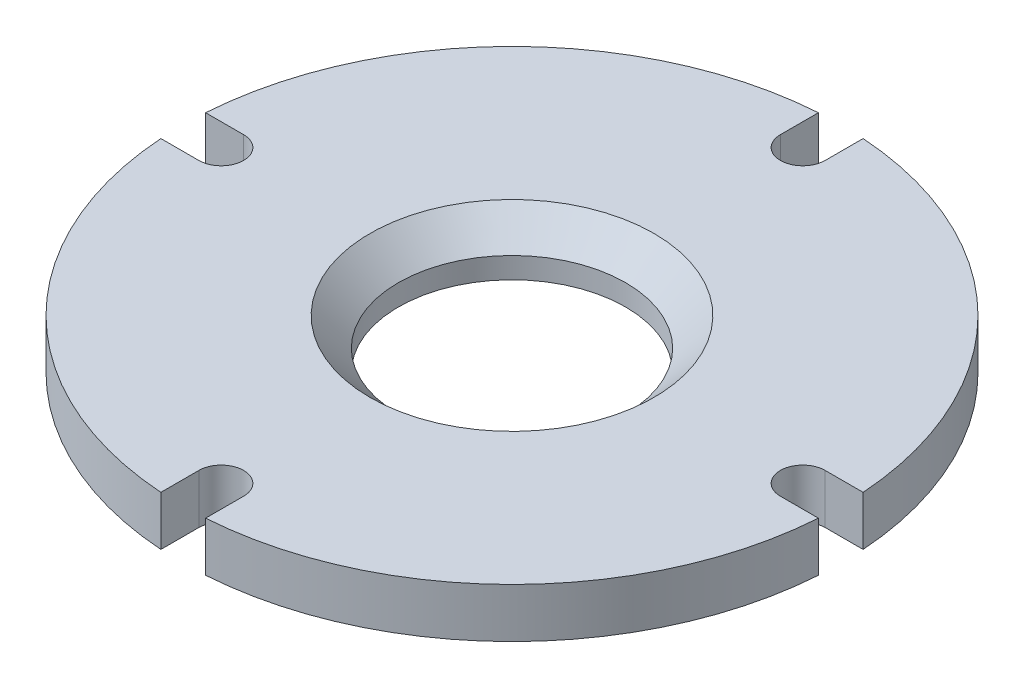
ISO-10303-21;
HEADER;
FILE_DESCRIPTION(('STEP AP214'),'2;1');
FILE_NAME('part.step','',(''),(''),'','','');
FILE_SCHEMA(('AUTOMOTIVE_DESIGN { 1 0 10303 214 1 1 1 1 }'));
ENDSEC;
DATA;
#1=APPLICATION_CONTEXT('core data for automotive mechanical design processes');
#2=APPLICATION_PROTOCOL_DEFINITION('international standard','automotive_design',2000,#1);
#3=PRODUCT_CONTEXT('',#1,'mechanical');
#4=PRODUCT('Part','Part','',(#3));
#5=PRODUCT_RELATED_PRODUCT_CATEGORY('part','',(#4));
#6=PRODUCT_DEFINITION_FORMATION('','',#4);
#7=PRODUCT_DEFINITION_CONTEXT('part definition',#1,'design');
#8=PRODUCT_DEFINITION('design','',#6,#7);
#9=PRODUCT_DEFINITION_SHAPE('','',#8);
#10=(LENGTH_UNIT() NAMED_UNIT(*) SI_UNIT(.MILLI.,.METRE.));
#11=(NAMED_UNIT(*) PLANE_ANGLE_UNIT() SI_UNIT($,.RADIAN.));
#12=(NAMED_UNIT(*) SI_UNIT($,.STERADIAN.) SOLID_ANGLE_UNIT());
#13=UNCERTAINTY_MEASURE_WITH_UNIT(LENGTH_MEASURE(1.E-05),#10,'distance_accuracy_value','');
#14=(GEOMETRIC_REPRESENTATION_CONTEXT(3) GLOBAL_UNCERTAINTY_ASSIGNED_CONTEXT((#13)) GLOBAL_UNIT_ASSIGNED_CONTEXT((#10,
#11,#12)) REPRESENTATION_CONTEXT('',''));
#15=CARTESIAN_POINT('',(0.,0.,0.));
#16=DIRECTION('',(0.,0.,1.));
#17=DIRECTION('',(1.,0.,0.));
#18=AXIS2_PLACEMENT_3D('',#15,#16,#17);
#19=CARTESIAN_POINT('',(0.,-5.53079166666667,0.));
#20=DIRECTION('',(0.,-1.,0.));
#21=DIRECTION('',(0.,0.,-1.));
#22=AXIS2_PLACEMENT_3D('',#19,#20,#21);
#23=PLANE('',#22);
#24=CARTESIAN_POINT('',(0.,-5.53079166666667,0.));
#25=DIRECTION('',(0.,-1.,0.));
#26=DIRECTION('',(0.,0.,-1.));
#27=AXIS2_PLACEMENT_3D('',#24,#25,#26);
#28=CIRCLE('',#27,12.7);
#29=CARTESIAN_POINT('',(0.,-5.53079166666667,-12.7));
#30=VERTEX_POINT('',#29);
#31=EDGE_CURVE('E332',#30,#30,#28,.T.);
#32=ORIENTED_EDGE('',*,*,#31,.F.);
#33=EDGE_LOOP('',(#32));
#34=FACE_BOUND('',#33,.T.);
#35=CARTESIAN_POINT('',(0.,-5.53079166666667,0.));
#36=DIRECTION('',(0.,-1.,0.));
#37=DIRECTION('',(0.,0.,-1.));
#38=AXIS2_PLACEMENT_3D('',#35,#36,#37);
#39=CIRCLE('',#38,13.97);
#40=CARTESIAN_POINT('',(0.,-5.53079166666667,-13.97));
#41=VERTEX_POINT('',#40);
#42=EDGE_CURVE('E767',#41,#41,#39,.T.);
#43=ORIENTED_EDGE('',*,*,#42,.T.);
#44=EDGE_LOOP('',(#43));
#45=FACE_BOUND('',#44,.T.);
#46=ADVANCED_FACE('F41',(#34,#45),#23,.T.);
#47=CARTESIAN_POINT('',(0.,-5.52979166666667,0.));
#48=DIRECTION('',(0.,1.,0.));
#49=DIRECTION('',(0.,0.,1.));
#50=AXIS2_PLACEMENT_3D('',#47,#48,#49);
#51=CYLINDRICAL_SURFACE('',#50,36.83);
#52=DIRECTION('',(0.,1.,0.));
#53=VECTOR('',#52,1.);
#54=CARTESIAN_POINT('',(36.7450527282245,-5.52979166666667,2.49999999999987));
#55=LINE('',#54,#53);
#56=CARTESIAN_POINT('',(36.7450527282245,0.,2.49999999999987));
#57=VERTEX_POINT('',#56);
#58=CARTESIAN_POINT('',(36.7450527282245,-5.52979166666667,2.49999999999987));
#59=VERTEX_POINT('',#58);
#60=EDGE_CURVE('E273',#57,#59,#55,.F.);
#61=ORIENTED_EDGE('',*,*,#60,.F.);
#62=CARTESIAN_POINT('',(0.,0.,0.));
#63=DIRECTION('',(0.,1.,0.));
#64=DIRECTION('',(0.,0.,1.));
#65=AXIS2_PLACEMENT_3D('',#62,#63,#64);
#66=CIRCLE('',#65,36.83);
#67=CARTESIAN_POINT('',(2.5,0.,36.7450527282245));
#68=VERTEX_POINT('',#67);
#69=EDGE_CURVE('E355',#68,#57,#66,.T.);
#70=ORIENTED_EDGE('',*,*,#69,.F.);
#71=DIRECTION('',(0.,1.,0.));
#72=VECTOR('',#71,1.);
#73=CARTESIAN_POINT('',(2.5,-5.52979166666667,36.7450527282245));
#74=LINE('',#73,#72);
#75=CARTESIAN_POINT('',(2.5,-5.52979166666667,36.7450527282245));
#76=VERTEX_POINT('',#75);
#77=EDGE_CURVE('E299',#76,#68,#74,.T.);
#78=ORIENTED_EDGE('',*,*,#77,.F.);
#79=CARTESIAN_POINT('',(0.,-5.52979166666667,0.));
#80=DIRECTION('',(0.,1.,0.));
#81=DIRECTION('',(0.,0.,1.));
#82=AXIS2_PLACEMENT_3D('',#79,#80,#81);
#83=CIRCLE('',#82,36.83);
#84=EDGE_CURVE('E354',#76,#59,#83,.T.);
#85=ORIENTED_EDGE('',*,*,#84,.T.);
#86=EDGE_LOOP('',(#61,#70,#78,#85));
#87=FACE_BOUND('',#86,.T.);
#88=ADVANCED_FACE('F393',(#87),#51,.T.);
#89=DIRECTION('',(0.,1.,0.));
#90=VECTOR('',#89,1.);
#91=CARTESIAN_POINT('',(36.7450527282245,-5.52979166666667,-2.50000000000013));
#92=LINE('',#91,#90);
#93=CARTESIAN_POINT('',(36.7450527282245,-5.52979166666667,-2.50000000000013));
#94=VERTEX_POINT('',#93);
#95=CARTESIAN_POINT('',(36.7450527282245,0.,-2.50000000000013));
#96=VERTEX_POINT('',#95);
#97=EDGE_CURVE('E187',#94,#96,#92,.T.);
#98=ORIENTED_EDGE('',*,*,#97,.F.);
#99=CARTESIAN_POINT('',(2.5,-5.52979166666667,-36.7450527282245));
#100=VERTEX_POINT('',#99);
#101=EDGE_CURVE('E363',#94,#100,#83,.T.);
#102=ORIENTED_EDGE('',*,*,#101,.T.);
#103=DIRECTION('',(0.,1.,0.));
#104=VECTOR('',#103,1.);
#105=CARTESIAN_POINT('',(2.5,-5.52979166666667,-36.7450527282245));
#106=LINE('',#105,#104);
#107=CARTESIAN_POINT('',(2.5,0.,-36.7450527282245));
#108=VERTEX_POINT('',#107);
#109=EDGE_CURVE('E268',#108,#100,#106,.F.);
#110=ORIENTED_EDGE('',*,*,#109,.F.);
#111=EDGE_CURVE('E359',#96,#108,#66,.T.);
#112=ORIENTED_EDGE('',*,*,#111,.F.);
#113=EDGE_LOOP('',(#98,#102,#110,#112));
#114=FACE_BOUND('',#113,.T.);
#115=ADVANCED_FACE('F400',(#114),#51,.T.);
#116=DIRECTION('',(0.,1.,0.));
#117=VECTOR('',#116,1.);
#118=CARTESIAN_POINT('',(-2.5,-5.52979166666667,-36.7450527282245));
#119=LINE('',#118,#117);
#120=CARTESIAN_POINT('',(-2.5,-5.52979166666667,-36.7450527282245));
#121=VERTEX_POINT('',#120);
#122=CARTESIAN_POINT('',(-2.5,0.,-36.7450527282245));
#123=VERTEX_POINT('',#122);
#124=EDGE_CURVE('E65',#121,#123,#119,.T.);
#125=ORIENTED_EDGE('',*,*,#124,.F.);
#126=CARTESIAN_POINT('',(-36.7450527282245,-5.52979166666667,-2.49999999999962));
#127=VERTEX_POINT('',#126);
#128=EDGE_CURVE('E467',#121,#127,#83,.T.);
#129=ORIENTED_EDGE('',*,*,#128,.T.);
#130=DIRECTION('',(0.,1.,0.));
#131=VECTOR('',#130,1.);
#132=CARTESIAN_POINT('',(-36.7450527282245,-5.52979166666667,-2.49999999999961));
#133=LINE('',#132,#131);
#134=CARTESIAN_POINT('',(-36.7450527282245,0.,-2.49999999999962));
#135=VERTEX_POINT('',#134);
#136=EDGE_CURVE('E263',#135,#127,#133,.F.);
#137=ORIENTED_EDGE('',*,*,#136,.F.);
#138=EDGE_CURVE('E488',#123,#135,#66,.T.);
#139=ORIENTED_EDGE('',*,*,#138,.F.);
#140=EDGE_LOOP('',(#125,#129,#137,#139));
#141=FACE_BOUND('',#140,.T.);
#142=ADVANCED_FACE('F442',(#141),#51,.T.);
#143=DIRECTION('',(0.,1.,0.));
#144=VECTOR('',#143,1.);
#145=CARTESIAN_POINT('',(-36.7450527282245,-5.52979166666667,2.50000000000038));
#146=LINE('',#145,#144);
#147=CARTESIAN_POINT('',(-36.7450527282245,-5.52979166666667,2.50000000000038));
#148=VERTEX_POINT('',#147);
#149=CARTESIAN_POINT('',(-36.7450527282245,0.,2.50000000000038));
#150=VERTEX_POINT('',#149);
#151=EDGE_CURVE('E57',#148,#150,#146,.T.);
#152=ORIENTED_EDGE('',*,*,#151,.F.);
#153=CARTESIAN_POINT('',(-2.5,-5.52979166666667,36.7450527282245));
#154=VERTEX_POINT('',#153);
#155=EDGE_CURVE('E358',#148,#154,#83,.T.);
#156=ORIENTED_EDGE('',*,*,#155,.T.);
#157=DIRECTION('',(0.,1.,0.));
#158=VECTOR('',#157,1.);
#159=CARTESIAN_POINT('',(-2.5,-5.52979166666667,36.7450527282245));
#160=LINE('',#159,#158);
#161=CARTESIAN_POINT('',(-2.5,0.,36.7450527282245));
#162=VERTEX_POINT('',#161);
#163=EDGE_CURVE('E304',#162,#154,#160,.F.);
#164=ORIENTED_EDGE('',*,*,#163,.F.);
#165=EDGE_CURVE('E348',#150,#162,#66,.T.);
#166=ORIENTED_EDGE('',*,*,#165,.F.);
#167=EDGE_LOOP('',(#152,#156,#164,#166));
#168=FACE_BOUND('',#167,.T.);
#169=ADVANCED_FACE('F402',(#168),#51,.T.);
#170=CARTESIAN_POINT('',(36.83,-5.52979166666667,0.));
#171=DIRECTION('',(0.,-1.,0.));
#172=DIRECTION('',(0.,0.,-1.));
#173=AXIS2_PLACEMENT_3D('',#170,#171,#172);
#174=PLANE('',#173);
#175=DIRECTION('',(-1.,0.,0.));
#176=VECTOR('',#175,1.);
#177=CARTESIAN_POINT('',(32.5,-5.52979166666667,2.49999999999989));
#178=LINE('',#177,#176);
#179=CARTESIAN_POINT('',(32.5,-5.52979166666667,2.49999999999989));
#180=VERTEX_POINT('',#179);
#181=EDGE_CURVE('E197',#59,#180,#178,.T.);
#182=ORIENTED_EDGE('',*,*,#181,.F.);
#183=ORIENTED_EDGE('',*,*,#84,.F.);
#184=DIRECTION('',(0.,0.,1.));
#185=VECTOR('',#184,1.);
#186=CARTESIAN_POINT('',(2.5,-5.52979166666667,32.5));
#187=LINE('',#186,#185);
#188=CARTESIAN_POINT('',(2.5,-5.52979166666667,32.5));
#189=VERTEX_POINT('',#188);
#190=EDGE_CURVE('E290',#189,#76,#187,.T.);
#191=ORIENTED_EDGE('',*,*,#190,.F.);
#192=CARTESIAN_POINT('',(0.,-5.52979166666667,32.5));
#193=DIRECTION('',(0.,-1.,0.));
#194=DIRECTION('',(0.,0.,-1.));
#195=AXIS2_PLACEMENT_3D('',#192,#193,#194);
#196=CIRCLE('',#195,2.5);
#197=CARTESIAN_POINT('',(-2.5,-5.52979166666667,32.5));
#198=VERTEX_POINT('',#197);
#199=EDGE_CURVE('E276',#198,#189,#196,.T.);
#200=ORIENTED_EDGE('',*,*,#199,.F.);
#201=DIRECTION('',(0.,0.,-1.));
#202=VECTOR('',#201,1.);
#203=CARTESIAN_POINT('',(-2.5,-5.52979166666667,32.5));
#204=LINE('',#203,#202);
#205=EDGE_CURVE('E282',#154,#198,#204,.T.);
#206=ORIENTED_EDGE('',*,*,#205,.F.);
#207=ORIENTED_EDGE('',*,*,#155,.F.);
#208=DIRECTION('',(-1.,0.,0.));
#209=VECTOR('',#208,1.);
#210=CARTESIAN_POINT('',(-32.5,-5.52979166666667,2.50000000000034));
#211=LINE('',#210,#209);
#212=CARTESIAN_POINT('',(-32.5,-5.52979166666667,2.50000000000034));
#213=VERTEX_POINT('',#212);
#214=EDGE_CURVE('E250',#213,#148,#211,.T.);
#215=ORIENTED_EDGE('',*,*,#214,.F.);
#216=CARTESIAN_POINT('',(-32.5,-5.52979166666667,3.40393242855307E-13));
#217=DIRECTION('',(0.,-1.,0.));
#218=DIRECTION('',(1.,0.,0.));
#219=AXIS2_PLACEMENT_3D('',#216,#217,#218);
#220=CIRCLE('',#219,2.5);
#221=CARTESIAN_POINT('',(-32.5,-5.52979166666667,-2.49999999999966));
#222=VERTEX_POINT('',#221);
#223=EDGE_CURVE('E246',#222,#213,#220,.T.);
#224=ORIENTED_EDGE('',*,*,#223,.F.);
#225=DIRECTION('',(1.,0.,0.));
#226=VECTOR('',#225,1.);
#227=CARTESIAN_POINT('',(-32.5,-5.52979166666667,-2.49999999999966));
#228=LINE('',#227,#226);
#229=EDGE_CURVE('E242',#127,#222,#228,.T.);
#230=ORIENTED_EDGE('',*,*,#229,.F.);
#231=ORIENTED_EDGE('',*,*,#128,.F.);
#232=DIRECTION('',(0.,0.,-1.));
#233=VECTOR('',#232,1.);
#234=CARTESIAN_POINT('',(-2.5,-5.52979166666667,-32.5));
#235=LINE('',#234,#233);
#236=CARTESIAN_POINT('',(-2.5,-5.52979166666667,-32.5));
#237=VERTEX_POINT('',#236);
#238=EDGE_CURVE('E226',#237,#121,#235,.T.);
#239=ORIENTED_EDGE('',*,*,#238,.F.);
#240=CARTESIAN_POINT('',(0.,-5.52979166666667,-32.5));
#241=DIRECTION('',(0.,-1.,0.));
#242=DIRECTION('',(0.,0.,1.));
#243=AXIS2_PLACEMENT_3D('',#240,#241,#242);
#244=CIRCLE('',#243,2.5);
#245=CARTESIAN_POINT('',(2.5,-5.52979166666667,-32.5));
#246=VERTEX_POINT('',#245);
#247=EDGE_CURVE('E222',#246,#237,#244,.T.);
#248=ORIENTED_EDGE('',*,*,#247,.F.);
#249=DIRECTION('',(0.,0.,1.));
#250=VECTOR('',#249,1.);
#251=CARTESIAN_POINT('',(2.5,-5.52979166666667,-32.5));
#252=LINE('',#251,#250);
#253=EDGE_CURVE('E218',#100,#246,#252,.T.);
#254=ORIENTED_EDGE('',*,*,#253,.F.);
#255=ORIENTED_EDGE('',*,*,#101,.F.);
#256=DIRECTION('',(1.,0.,0.));
#257=VECTOR('',#256,1.);
#258=CARTESIAN_POINT('',(32.5,-5.52979166666667,-2.50000000000011));
#259=LINE('',#258,#257);
#260=CARTESIAN_POINT('',(32.5,-5.52979166666667,-2.50000000000011));
#261=VERTEX_POINT('',#260);
#262=EDGE_CURVE('E200',#261,#94,#259,.T.);
#263=ORIENTED_EDGE('',*,*,#262,.F.);
#264=CARTESIAN_POINT('',(32.5,-5.52979166666667,-1.13446955830504E-13));
#265=DIRECTION('',(0.,-1.,0.));
#266=DIRECTION('',(-1.,0.,0.));
#267=AXIS2_PLACEMENT_3D('',#264,#265,#266);
#268=CIRCLE('',#267,2.5);
#269=EDGE_CURVE('E177',#180,#261,#268,.T.);
#270=ORIENTED_EDGE('',*,*,#269,.F.);
#271=EDGE_LOOP('',(#182,#183,#191,#200,#206,#207,#215,#224,#230,#231,#239,#248,#254,#255,#263,#270));
#272=FACE_BOUND('',#271,.T.);
#273=CARTESIAN_POINT('',(0.,-5.52979166666667,0.));
#274=DIRECTION('',(0.,-1.,0.));
#275=DIRECTION('',(0.,0.,-1.));
#276=AXIS2_PLACEMENT_3D('',#273,#274,#275);
#277=CIRCLE('',#276,27.5);
#278=CARTESIAN_POINT('',(0.,-5.52979166666667,-27.5));
#279=VERTEX_POINT('',#278);
#280=EDGE_CURVE('E349',#279,#279,#277,.T.);
#281=ORIENTED_EDGE('',*,*,#280,.F.);
#282=EDGE_LOOP('',(#281));
#283=FACE_BOUND('',#282,.T.);
#284=ADVANCED_FACE('F433',(#272,#283),#174,.T.);
#285=CARTESIAN_POINT('',(0.,0.,0.));
#286=DIRECTION('',(0.,1.,0.));
#287=DIRECTION('',(0.,0.,1.));
#288=AXIS2_PLACEMENT_3D('',#285,#286,#287);
#289=PLANE('',#288);
#290=CARTESIAN_POINT('',(0.,0.,0.));
#291=DIRECTION('',(0.,1.,0.));
#292=DIRECTION('',(0.,0.,1.));
#293=AXIS2_PLACEMENT_3D('',#290,#291,#292);
#294=CIRCLE('',#293,15.875);
#295=CARTESIAN_POINT('',(0.,0.,15.875));
#296=VERTEX_POINT('',#295);
#297=EDGE_CURVE('E50',#296,#296,#294,.F.);
#298=ORIENTED_EDGE('',*,*,#297,.T.);
#299=EDGE_LOOP('',(#298));
#300=FACE_BOUND('',#299,.T.);
#301=DIRECTION('',(1.,0.,0.));
#302=VECTOR('',#301,1.);
#303=CARTESIAN_POINT('',(0.,0.,2.5));
#304=LINE('',#303,#302);
#305=CARTESIAN_POINT('',(32.5,0.,2.49999999999989));
#306=VERTEX_POINT('',#305);
#307=EDGE_CURVE('E195',#306,#57,#304,.T.);
#308=ORIENTED_EDGE('',*,*,#307,.F.);
#309=CARTESIAN_POINT('',(32.5,0.,-1.13446955830504E-13));
#310=DIRECTION('',(0.,-1.,0.));
#311=DIRECTION('',(-1.,0.,0.));
#312=AXIS2_PLACEMENT_3D('',#309,#310,#311);
#313=CIRCLE('',#312,2.5);
#314=CARTESIAN_POINT('',(32.5,0.,-2.50000000000011));
#315=VERTEX_POINT('',#314);
#316=EDGE_CURVE('E174',#306,#315,#313,.T.);
#317=ORIENTED_EDGE('',*,*,#316,.T.);
#318=DIRECTION('',(1.,0.,0.));
#319=VECTOR('',#318,1.);
#320=CARTESIAN_POINT('',(32.5,0.,-2.50000000000011));
#321=LINE('',#320,#319);
#322=EDGE_CURVE('E182',#315,#96,#321,.T.);
#323=ORIENTED_EDGE('',*,*,#322,.T.);
#324=ORIENTED_EDGE('',*,*,#111,.T.);
#325=DIRECTION('',(0.,0.,-1.));
#326=VECTOR('',#325,1.);
#327=CARTESIAN_POINT('',(2.5,0.,0.));
#328=LINE('',#327,#326);
#329=CARTESIAN_POINT('',(2.5,0.,-32.5));
#330=VERTEX_POINT('',#329);
#331=EDGE_CURVE('E370',#330,#108,#328,.T.);
#332=ORIENTED_EDGE('',*,*,#331,.F.);
#333=CARTESIAN_POINT('',(0.,0.,-32.5));
#334=DIRECTION('',(0.,-1.,0.));
#335=DIRECTION('',(0.,0.,1.));
#336=AXIS2_PLACEMENT_3D('',#333,#334,#335);
#337=CIRCLE('',#336,2.5);
#338=CARTESIAN_POINT('',(-2.5,0.,-32.5));
#339=VERTEX_POINT('',#338);
#340=EDGE_CURVE('E213',#330,#339,#337,.T.);
#341=ORIENTED_EDGE('',*,*,#340,.T.);
#342=DIRECTION('',(0.,0.,-1.));
#343=VECTOR('',#342,1.);
#344=CARTESIAN_POINT('',(-2.5,0.,-32.5));
#345=LINE('',#344,#343);
#346=EDGE_CURVE('E217',#339,#123,#345,.T.);
#347=ORIENTED_EDGE('',*,*,#346,.T.);
#348=ORIENTED_EDGE('',*,*,#138,.T.);
#349=DIRECTION('',(-1.,0.,0.));
#350=VECTOR('',#349,1.);
#351=CARTESIAN_POINT('',(0.,0.,-2.5));
#352=LINE('',#351,#350);
#353=CARTESIAN_POINT('',(-32.5,0.,-2.49999999999966));
#354=VERTEX_POINT('',#353);
#355=EDGE_CURVE('E367',#354,#135,#352,.T.);
#356=ORIENTED_EDGE('',*,*,#355,.F.);
#357=CARTESIAN_POINT('',(-32.5,0.,3.40393242855307E-13));
#358=DIRECTION('',(0.,-1.,0.));
#359=DIRECTION('',(1.,0.,0.));
#360=AXIS2_PLACEMENT_3D('',#357,#358,#359);
#361=CIRCLE('',#360,2.5);
#362=CARTESIAN_POINT('',(-32.5,0.,2.50000000000034));
#363=VERTEX_POINT('',#362);
#364=EDGE_CURVE('E237',#354,#363,#361,.T.);
#365=ORIENTED_EDGE('',*,*,#364,.T.);
#366=DIRECTION('',(-1.,0.,0.));
#367=VECTOR('',#366,1.);
#368=CARTESIAN_POINT('',(-32.5,0.,2.50000000000034));
#369=LINE('',#368,#367);
#370=EDGE_CURVE('E241',#363,#150,#369,.T.);
#371=ORIENTED_EDGE('',*,*,#370,.T.);
#372=ORIENTED_EDGE('',*,*,#165,.T.);
#373=DIRECTION('',(0.,0.,1.));
#374=VECTOR('',#373,1.);
#375=CARTESIAN_POINT('',(-2.5,0.,0.));
#376=LINE('',#375,#374);
#377=CARTESIAN_POINT('',(-2.5,0.,32.5));
#378=VERTEX_POINT('',#377);
#379=EDGE_CURVE('E353',#378,#162,#376,.T.);
#380=ORIENTED_EDGE('',*,*,#379,.F.);
#381=CARTESIAN_POINT('',(0.,0.,32.5));
#382=DIRECTION('',(0.,-1.,0.));
#383=DIRECTION('',(0.,0.,-1.));
#384=AXIS2_PLACEMENT_3D('',#381,#382,#383);
#385=CIRCLE('',#384,2.5);
#386=CARTESIAN_POINT('',(2.5,0.,32.5));
#387=VERTEX_POINT('',#386);
#388=EDGE_CURVE('E277',#378,#387,#385,.T.);
#389=ORIENTED_EDGE('',*,*,#388,.T.);
#390=DIRECTION('',(0.,0.,1.));
#391=VECTOR('',#390,1.);
#392=CARTESIAN_POINT('',(2.5,0.,32.5));
#393=LINE('',#392,#391);
#394=EDGE_CURVE('E281',#387,#68,#393,.T.);
#395=ORIENTED_EDGE('',*,*,#394,.T.);
#396=ORIENTED_EDGE('',*,*,#69,.T.);
#397=EDGE_LOOP('',(#308,#317,#323,#324,#332,#341,#347,#348,#356,#365,#371,#372,#380,#389,#395,#396));
#398=FACE_BOUND('',#397,.T.);
#399=ADVANCED_FACE('F193',(#300,#398),#289,.T.);
#400=CARTESIAN_POINT('',(0.,-5.53079166666667,0.));
#401=DIRECTION('',(0.,1.,0.));
#402=DIRECTION('',(0.,0.,1.));
#403=AXIS2_PLACEMENT_3D('',#400,#401,#402);
#404=CYLINDRICAL_SURFACE('',#403,27.5);
#405=CARTESIAN_POINT('',(0.,-5.53079166666667,0.));
#406=DIRECTION('',(0.,-1.,0.));
#407=DIRECTION('',(0.,0.,-1.));
#408=AXIS2_PLACEMENT_3D('',#405,#406,#407);
#409=CIRCLE('',#408,27.5);
#410=CARTESIAN_POINT('',(0.,-5.53079166666667,-27.5));
#411=VERTEX_POINT('',#410);
#412=EDGE_CURVE('E344',#411,#411,#409,.T.);
#413=ORIENTED_EDGE('',*,*,#412,.F.);
#414=EDGE_LOOP('',(#413));
#415=FACE_BOUND('',#414,.T.);
#416=ORIENTED_EDGE('',*,*,#280,.T.);
#417=EDGE_LOOP('',(#416));
#418=FACE_BOUND('',#417,.T.);
#419=ADVANCED_FACE('F409',(#415,#418),#404,.T.);
#420=CARTESIAN_POINT('',(0.,-5.53079166666667,0.));
#421=DIRECTION('',(0.,-1.,0.));
#422=DIRECTION('',(0.,0.,-1.));
#423=AXIS2_PLACEMENT_3D('',#420,#421,#422);
#424=CIRCLE('',#423,16.2052);
#425=CARTESIAN_POINT('',(0.,-5.53079166666667,-16.2052));
#426=VERTEX_POINT('',#425);
#427=EDGE_CURVE('E203',#426,#426,#424,.T.);
#428=ORIENTED_EDGE('',*,*,#427,.F.);
#429=EDGE_LOOP('',(#428));
#430=FACE_BOUND('',#429,.T.);
#431=CARTESIAN_POINT('',(-14.6017550315024,-5.53079166666667,-14.601755031502));
#432=DIRECTION('',(0.,-1.,0.));
#433=DIRECTION('',(0.,0.,-1.));
#434=AXIS2_PLACEMENT_3D('',#431,#432,#433);
#435=CIRCLE('',#434,1.13029999999999);
#436=CARTESIAN_POINT('',(-14.6017550315024,-5.53079166666667,-15.732055031502));
#437=VERTEX_POINT('',#436);
#438=EDGE_CURVE('E308',#437,#437,#435,.T.);
#439=ORIENTED_EDGE('',*,*,#438,.F.);
#440=EDGE_LOOP('',(#439));
#441=FACE_BOUND('',#440,.T.);
#442=CARTESIAN_POINT('',(14.6017550315022,-5.53079166666667,-14.6017550315022));
#443=DIRECTION('',(0.,-1.,0.));
#444=DIRECTION('',(0.,0.,-1.));
#445=AXIS2_PLACEMENT_3D('',#442,#443,#444);
#446=CIRCLE('',#445,1.13029999999999);
#447=CARTESIAN_POINT('',(14.6017550315022,-5.53079166666667,-15.7320550315022));
#448=VERTEX_POINT('',#447);
#449=EDGE_CURVE('E316',#448,#448,#446,.T.);
#450=ORIENTED_EDGE('',*,*,#449,.F.);
#451=EDGE_LOOP('',(#450));
#452=FACE_BOUND('',#451,.T.);
#453=CARTESIAN_POINT('',(14.6017550315023,-5.53079166666667,14.6017550315021));
#454=DIRECTION('',(0.,-1.,0.));
#455=DIRECTION('',(0.,0.,-1.));
#456=AXIS2_PLACEMENT_3D('',#453,#454,#455);
#457=CIRCLE('',#456,1.13029999999999);
#458=CARTESIAN_POINT('',(14.6017550315023,-5.53079166666667,13.4714550315021));
#459=VERTEX_POINT('',#458);
#460=EDGE_CURVE('E324',#459,#459,#457,.T.);
#461=ORIENTED_EDGE('',*,*,#460,.F.);
#462=EDGE_LOOP('',(#461));
#463=FACE_BOUND('',#462,.T.);
#464=CARTESIAN_POINT('',(-14.6017550315022,-5.53079166666667,14.6017550315022));
#465=DIRECTION('',(0.,-1.,0.));
#466=DIRECTION('',(0.,0.,-1.));
#467=AXIS2_PLACEMENT_3D('',#464,#465,#466);
#468=CIRCLE('',#467,1.13029999999999);
#469=CARTESIAN_POINT('',(-14.6017550315022,-5.53079166666667,13.4714550315022));
#470=VERTEX_POINT('',#469);
#471=EDGE_CURVE('E336',#470,#470,#468,.T.);
#472=ORIENTED_EDGE('',*,*,#471,.F.);
#473=EDGE_LOOP('',(#472));
#474=FACE_BOUND('',#473,.T.);
#475=ORIENTED_EDGE('',*,*,#412,.T.);
#476=EDGE_LOOP('',(#475));
#477=FACE_BOUND('',#476,.T.);
#478=ADVANCED_FACE('F396',(#430,#441,#452,#463,#474,#477),#23,.T.);
#479=CARTESIAN_POINT('',(-14.6017550315022,-2.22879166666667,14.6017550315022));
#480=DIRECTION('',(0.,-1.,0.));
#481=DIRECTION('',(0.,0.,-1.));
#482=AXIS2_PLACEMENT_3D('',#479,#480,#481);
#483=CONICAL_SURFACE('',#482,1.1303,1.02974425867665);
#484=CARTESIAN_POINT('',(-14.6017550315022,-1.54963890897981,14.6017550315022));
#485=VERTEX_POINT('',#484);
#486=VERTEX_LOOP('',#485);
#487=FACE_BOUND('',#486,.T.);
#488=CARTESIAN_POINT('',(-14.6017550315022,-2.22879166666667,14.6017550315022));
#489=DIRECTION('',(0.,-1.,0.));
#490=DIRECTION('',(0.,0.,-1.));
#491=AXIS2_PLACEMENT_3D('',#488,#489,#490);
#492=CIRCLE('',#491,1.1303);
#493=CARTESIAN_POINT('',(-14.6017550315022,-2.22879166666667,13.4714550315022));
#494=VERTEX_POINT('',#493);
#495=EDGE_CURVE('E340',#494,#494,#492,.T.);
#496=ORIENTED_EDGE('',*,*,#495,.T.);
#497=EDGE_LOOP('',(#496));
#498=FACE_BOUND('',#497,.T.);
#499=ADVANCED_FACE('F408',(#487,#498),#483,.F.);
#500=CARTESIAN_POINT('',(-14.6017550315022,-5.53079166666667,14.6017550315022));
#501=DIRECTION('',(0.,-1.,0.));
#502=DIRECTION('',(0.,0.,-1.));
#503=AXIS2_PLACEMENT_3D('',#500,#501,#502);
#504=CYLINDRICAL_SURFACE('',#503,1.13029999999999);
#505=ORIENTED_EDGE('',*,*,#495,.F.);
#506=EDGE_LOOP('',(#505));
#507=FACE_BOUND('',#506,.T.);
#508=ORIENTED_EDGE('',*,*,#471,.T.);
#509=EDGE_LOOP('',(#508));
#510=FACE_BOUND('',#509,.T.);
#511=ADVANCED_FACE('F415',(#507,#510),#504,.F.);
#512=CARTESIAN_POINT('',(0.,0.,0.));
#513=DIRECTION('',(0.,-1.,0.));
#514=DIRECTION('',(0.,0.,-1.));
#515=AXIS2_PLACEMENT_3D('',#512,#513,#514);
#516=CYLINDRICAL_SURFACE('',#515,12.7);
#517=CARTESIAN_POINT('',(0.,-3.17500000000001,0.));
#518=DIRECTION('',(0.,1.,0.));
#519=DIRECTION('',(0.,0.,1.));
#520=AXIS2_PLACEMENT_3D('',#517,#518,#519);
#521=CIRCLE('',#520,12.7);
#522=CARTESIAN_POINT('',(0.,-3.17500000000001,12.7));
#523=VERTEX_POINT('',#522);
#524=EDGE_CURVE('E11',#523,#523,#521,.T.);
#525=ORIENTED_EDGE('',*,*,#524,.T.);
#526=EDGE_LOOP('',(#525));
#527=FACE_BOUND('',#526,.T.);
#528=ORIENTED_EDGE('',*,*,#31,.T.);
#529=EDGE_LOOP('',(#528));
#530=FACE_BOUND('',#529,.T.);
#531=ADVANCED_FACE('F599',(#527,#530),#516,.F.);
#532=CARTESIAN_POINT('',(14.6017550315023,-2.22879166666667,14.6017550315021));
#533=DIRECTION('',(0.,-1.,0.));
#534=DIRECTION('',(0.,0.,-1.));
#535=AXIS2_PLACEMENT_3D('',#532,#533,#534);
#536=CONICAL_SURFACE('',#535,1.1303,1.02974425867665);
#537=CARTESIAN_POINT('',(14.6017550315023,-1.54963890897981,14.6017550315021));
#538=VERTEX_POINT('',#537);
#539=VERTEX_LOOP('',#538);
#540=FACE_BOUND('',#539,.T.);
#541=CARTESIAN_POINT('',(14.6017550315023,-2.22879166666667,14.6017550315021));
#542=DIRECTION('',(0.,-1.,0.));
#543=DIRECTION('',(0.,0.,-1.));
#544=AXIS2_PLACEMENT_3D('',#541,#542,#543);
#545=CIRCLE('',#544,1.1303);
#546=CARTESIAN_POINT('',(14.6017550315023,-2.22879166666667,13.4714550315021));
#547=VERTEX_POINT('',#546);
#548=EDGE_CURVE('E328',#547,#547,#545,.T.);
#549=ORIENTED_EDGE('',*,*,#548,.T.);
#550=EDGE_LOOP('',(#549));
#551=FACE_BOUND('',#550,.T.);
#552=ADVANCED_FACE('F589',(#540,#551),#536,.F.);
#553=CARTESIAN_POINT('',(14.6017550315023,-5.53079166666667,14.6017550315021));
#554=DIRECTION('',(0.,-1.,0.));
#555=DIRECTION('',(0.,0.,-1.));
#556=AXIS2_PLACEMENT_3D('',#553,#554,#555);
#557=CYLINDRICAL_SURFACE('',#556,1.13029999999999);
#558=ORIENTED_EDGE('',*,*,#548,.F.);
#559=EDGE_LOOP('',(#558));
#560=FACE_BOUND('',#559,.T.);
#561=ORIENTED_EDGE('',*,*,#460,.T.);
#562=EDGE_LOOP('',(#561));
#563=FACE_BOUND('',#562,.T.);
#564=ADVANCED_FACE('F579',(#560,#563),#557,.F.);
#565=CARTESIAN_POINT('',(14.6017550315022,-2.22879166666667,-14.6017550315022));
#566=DIRECTION('',(0.,-1.,0.));
#567=DIRECTION('',(0.,0.,-1.));
#568=AXIS2_PLACEMENT_3D('',#565,#566,#567);
#569=CONICAL_SURFACE('',#568,1.1303,1.02974425867665);
#570=CARTESIAN_POINT('',(14.6017550315022,-1.54963890897981,-14.6017550315022));
#571=VERTEX_POINT('',#570);
#572=VERTEX_LOOP('',#571);
#573=FACE_BOUND('',#572,.T.);
#574=CARTESIAN_POINT('',(14.6017550315022,-2.22879166666667,-14.6017550315022));
#575=DIRECTION('',(0.,-1.,0.));
#576=DIRECTION('',(0.,0.,-1.));
#577=AXIS2_PLACEMENT_3D('',#574,#575,#576);
#578=CIRCLE('',#577,1.1303);
#579=CARTESIAN_POINT('',(14.6017550315022,-2.22879166666667,-15.7320550315022));
#580=VERTEX_POINT('',#579);
#581=EDGE_CURVE('E320',#580,#580,#578,.T.);
#582=ORIENTED_EDGE('',*,*,#581,.T.);
#583=EDGE_LOOP('',(#582));
#584=FACE_BOUND('',#583,.T.);
#585=ADVANCED_FACE('F569',(#573,#584),#569,.F.);
#586=CARTESIAN_POINT('',(14.6017550315022,-5.53079166666667,-14.6017550315022));
#587=DIRECTION('',(0.,-1.,0.));
#588=DIRECTION('',(0.,0.,-1.));
#589=AXIS2_PLACEMENT_3D('',#586,#587,#588);
#590=CYLINDRICAL_SURFACE('',#589,1.13029999999999);
#591=ORIENTED_EDGE('',*,*,#581,.F.);
#592=EDGE_LOOP('',(#591));
#593=FACE_BOUND('',#592,.T.);
#594=ORIENTED_EDGE('',*,*,#449,.T.);
#595=EDGE_LOOP('',(#594));
#596=FACE_BOUND('',#595,.T.);
#597=ADVANCED_FACE('F559',(#593,#596),#590,.F.);
#598=CARTESIAN_POINT('',(-14.6017550315024,-2.22879166666667,-14.601755031502));
#599=DIRECTION('',(0.,-1.,0.));
#600=DIRECTION('',(0.,0.,-1.));
#601=AXIS2_PLACEMENT_3D('',#598,#599,#600);
#602=CONICAL_SURFACE('',#601,1.1303,1.02974425867665);
#603=CARTESIAN_POINT('',(-14.6017550315024,-1.54963890897981,-14.601755031502));
#604=VERTEX_POINT('',#603);
#605=VERTEX_LOOP('',#604);
#606=FACE_BOUND('',#605,.T.);
#607=CARTESIAN_POINT('',(-14.6017550315024,-2.22879166666667,-14.601755031502));
#608=DIRECTION('',(0.,-1.,0.));
#609=DIRECTION('',(0.,0.,-1.));
#610=AXIS2_PLACEMENT_3D('',#607,#608,#609);
#611=CIRCLE('',#610,1.1303);
#612=CARTESIAN_POINT('',(-14.6017550315024,-2.22879166666667,-15.732055031502));
#613=VERTEX_POINT('',#612);
#614=EDGE_CURVE('E312',#613,#613,#611,.T.);
#615=ORIENTED_EDGE('',*,*,#614,.T.);
#616=EDGE_LOOP('',(#615));
#617=FACE_BOUND('',#616,.T.);
#618=ADVANCED_FACE('F549',(#606,#617),#602,.F.);
#619=CARTESIAN_POINT('',(-14.6017550315024,-5.53079166666667,-14.601755031502));
#620=DIRECTION('',(0.,-1.,0.));
#621=DIRECTION('',(0.,0.,-1.));
#622=AXIS2_PLACEMENT_3D('',#619,#620,#621);
#623=CYLINDRICAL_SURFACE('',#622,1.13029999999999);
#624=ORIENTED_EDGE('',*,*,#614,.F.);
#625=EDGE_LOOP('',(#624));
#626=FACE_BOUND('',#625,.T.);
#627=ORIENTED_EDGE('',*,*,#438,.T.);
#628=EDGE_LOOP('',(#627));
#629=FACE_BOUND('',#628,.T.);
#630=ADVANCED_FACE('F540',(#626,#629),#623,.F.);
#631=CARTESIAN_POINT('',(0.,0.,32.5));
#632=DIRECTION('',(0.,-1.,0.));
#633=DIRECTION('',(0.,0.,-1.));
#634=AXIS2_PLACEMENT_3D('',#631,#632,#633);
#635=CYLINDRICAL_SURFACE('',#634,2.5);
#636=ORIENTED_EDGE('',*,*,#199,.T.);
#637=DIRECTION('',(0.,-1.,0.));
#638=VECTOR('',#637,1.);
#639=CARTESIAN_POINT('',(2.5,0.,32.5));
#640=LINE('',#639,#638);
#641=EDGE_CURVE('E286',#387,#189,#640,.T.);
#642=ORIENTED_EDGE('',*,*,#641,.F.);
#643=ORIENTED_EDGE('',*,*,#388,.F.);
#644=DIRECTION('',(0.,-1.,0.));
#645=VECTOR('',#644,1.);
#646=CARTESIAN_POINT('',(-2.5,0.,32.5));
#647=LINE('',#646,#645);
#648=EDGE_CURVE('E295',#378,#198,#647,.T.);
#649=ORIENTED_EDGE('',*,*,#648,.T.);
#650=EDGE_LOOP('',(#636,#642,#643,#649));
#651=FACE_BOUND('',#650,.T.);
#652=ADVANCED_FACE('F457',(#651),#635,.F.);
#653=CARTESIAN_POINT('',(-2.5,0.,32.5));
#654=DIRECTION('',(-1.,0.,0.));
#655=DIRECTION('',(0.,0.,1.));
#656=AXIS2_PLACEMENT_3D('',#653,#654,#655);
#657=PLANE('',#656);
#658=ORIENTED_EDGE('',*,*,#163,.T.);
#659=ORIENTED_EDGE('',*,*,#205,.T.);
#660=ORIENTED_EDGE('',*,*,#648,.F.);
#661=ORIENTED_EDGE('',*,*,#379,.T.);
#662=EDGE_LOOP('',(#658,#659,#660,#661));
#663=FACE_BOUND('',#662,.T.);
#664=ADVANCED_FACE('F463',(#663),#657,.F.);
#665=CARTESIAN_POINT('',(2.5,0.,32.5));
#666=DIRECTION('',(1.,0.,0.));
#667=DIRECTION('',(0.,0.,-1.));
#668=AXIS2_PLACEMENT_3D('',#665,#666,#667);
#669=PLANE('',#668);
#670=ORIENTED_EDGE('',*,*,#77,.T.);
#671=ORIENTED_EDGE('',*,*,#394,.F.);
#672=ORIENTED_EDGE('',*,*,#641,.T.);
#673=ORIENTED_EDGE('',*,*,#190,.T.);
#674=EDGE_LOOP('',(#670,#671,#672,#673));
#675=FACE_BOUND('',#674,.T.);
#676=ADVANCED_FACE('F453',(#675),#669,.F.);
#677=CARTESIAN_POINT('',(-32.5,0.,3.40393242855307E-13));
#678=DIRECTION('',(0.,-1.,0.));
#679=DIRECTION('',(0.,0.,-1.));
#680=AXIS2_PLACEMENT_3D('',#677,#678,#679);
#681=CYLINDRICAL_SURFACE('',#680,2.5);
#682=ORIENTED_EDGE('',*,*,#223,.T.);
#683=DIRECTION('',(0.,-1.,0.));
#684=VECTOR('',#683,1.);
#685=CARTESIAN_POINT('',(-32.5,0.,2.50000000000034));
#686=LINE('',#685,#684);
#687=EDGE_CURVE('E245',#363,#213,#686,.T.);
#688=ORIENTED_EDGE('',*,*,#687,.F.);
#689=ORIENTED_EDGE('',*,*,#364,.F.);
#690=DIRECTION('',(0.,-1.,0.));
#691=VECTOR('',#690,1.);
#692=CARTESIAN_POINT('',(-32.5,0.,-2.49999999999966));
#693=LINE('',#692,#691);
#694=EDGE_CURVE('E227',#354,#222,#693,.T.);
#695=ORIENTED_EDGE('',*,*,#694,.T.);
#696=EDGE_LOOP('',(#682,#688,#689,#695));
#697=FACE_BOUND('',#696,.T.);
#698=ADVANCED_FACE('F498',(#697),#681,.F.);
#699=CARTESIAN_POINT('',(-32.5,0.,-2.49999999999966));
#700=DIRECTION('',(0.,0.,-1.));
#701=DIRECTION('',(-1.,0.,0.));
#702=AXIS2_PLACEMENT_3D('',#699,#700,#701);
#703=PLANE('',#702);
#704=ORIENTED_EDGE('',*,*,#136,.T.);
#705=ORIENTED_EDGE('',*,*,#229,.T.);
#706=ORIENTED_EDGE('',*,*,#694,.F.);
#707=ORIENTED_EDGE('',*,*,#355,.T.);
#708=EDGE_LOOP('',(#704,#705,#706,#707));
#709=FACE_BOUND('',#708,.T.);
#710=ADVANCED_FACE('F501',(#709),#703,.F.);
#711=CARTESIAN_POINT('',(-32.5,0.,2.50000000000034));
#712=DIRECTION('',(0.,0.,1.));
#713=DIRECTION('',(1.,0.,0.));
#714=AXIS2_PLACEMENT_3D('',#711,#712,#713);
#715=PLANE('',#714);
#716=ORIENTED_EDGE('',*,*,#151,.T.);
#717=ORIENTED_EDGE('',*,*,#370,.F.);
#718=ORIENTED_EDGE('',*,*,#687,.T.);
#719=ORIENTED_EDGE('',*,*,#214,.T.);
#720=EDGE_LOOP('',(#716,#717,#718,#719));
#721=FACE_BOUND('',#720,.T.);
#722=ADVANCED_FACE('F495',(#721),#715,.F.);
#723=CARTESIAN_POINT('',(0.,0.,-32.5));
#724=DIRECTION('',(0.,-1.,0.));
#725=DIRECTION('',(0.,0.,-1.));
#726=AXIS2_PLACEMENT_3D('',#723,#724,#725);
#727=CYLINDRICAL_SURFACE('',#726,2.5);
#728=ORIENTED_EDGE('',*,*,#247,.T.);
#729=DIRECTION('',(0.,-1.,0.));
#730=VECTOR('',#729,1.);
#731=CARTESIAN_POINT('',(-2.5,0.,-32.5));
#732=LINE('',#731,#730);
#733=EDGE_CURVE('E221',#339,#237,#732,.T.);
#734=ORIENTED_EDGE('',*,*,#733,.F.);
#735=ORIENTED_EDGE('',*,*,#340,.F.);
#736=DIRECTION('',(0.,-1.,0.));
#737=VECTOR('',#736,1.);
#738=CARTESIAN_POINT('',(2.5,0.,-32.5));
#739=LINE('',#738,#737);
#740=EDGE_CURVE('E208',#330,#246,#739,.T.);
#741=ORIENTED_EDGE('',*,*,#740,.T.);
#742=EDGE_LOOP('',(#728,#734,#735,#741));
#743=FACE_BOUND('',#742,.T.);
#744=ADVANCED_FACE('F485',(#743),#727,.F.);
#745=CARTESIAN_POINT('',(2.5,0.,-32.5));
#746=DIRECTION('',(1.,0.,0.));
#747=DIRECTION('',(0.,0.,-1.));
#748=AXIS2_PLACEMENT_3D('',#745,#746,#747);
#749=PLANE('',#748);
#750=ORIENTED_EDGE('',*,*,#109,.T.);
#751=ORIENTED_EDGE('',*,*,#253,.T.);
#752=ORIENTED_EDGE('',*,*,#740,.F.);
#753=ORIENTED_EDGE('',*,*,#331,.T.);
#754=EDGE_LOOP('',(#750,#751,#752,#753));
#755=FACE_BOUND('',#754,.T.);
#756=ADVANCED_FACE('F482',(#755),#749,.F.);
#757=CARTESIAN_POINT('',(-2.5,0.,-32.5));
#758=DIRECTION('',(-1.,0.,0.));
#759=DIRECTION('',(0.,0.,1.));
#760=AXIS2_PLACEMENT_3D('',#757,#758,#759);
#761=PLANE('',#760);
#762=ORIENTED_EDGE('',*,*,#124,.T.);
#763=ORIENTED_EDGE('',*,*,#346,.F.);
#764=ORIENTED_EDGE('',*,*,#733,.T.);
#765=ORIENTED_EDGE('',*,*,#238,.T.);
#766=EDGE_LOOP('',(#762,#763,#764,#765));
#767=FACE_BOUND('',#766,.T.);
#768=ADVANCED_FACE('F689',(#767),#761,.F.);
#769=CARTESIAN_POINT('',(32.5,0.,-1.13446955830504E-13));
#770=DIRECTION('',(0.,-1.,0.));
#771=DIRECTION('',(0.,0.,-1.));
#772=AXIS2_PLACEMENT_3D('',#769,#770,#771);
#773=CYLINDRICAL_SURFACE('',#772,2.5);
#774=ORIENTED_EDGE('',*,*,#269,.T.);
#775=DIRECTION('',(0.,-1.,0.));
#776=VECTOR('',#775,1.);
#777=CARTESIAN_POINT('',(32.5,0.,-2.50000000000011));
#778=LINE('',#777,#776);
#779=EDGE_CURVE('E169',#315,#261,#778,.T.);
#780=ORIENTED_EDGE('',*,*,#779,.F.);
#781=ORIENTED_EDGE('',*,*,#316,.F.);
#782=DIRECTION('',(0.,-1.,0.));
#783=VECTOR('',#782,1.);
#784=CARTESIAN_POINT('',(32.5,0.,2.49999999999989));
#785=LINE('',#784,#783);
#786=EDGE_CURVE('E181',#306,#180,#785,.T.);
#787=ORIENTED_EDGE('',*,*,#786,.T.);
#788=EDGE_LOOP('',(#774,#780,#781,#787));
#789=FACE_BOUND('',#788,.T.);
#790=ADVANCED_FACE('F171',(#789),#773,.F.);
#791=CARTESIAN_POINT('',(32.5,0.,2.49999999999989));
#792=DIRECTION('',(0.,0.,1.));
#793=DIRECTION('',(1.,0.,0.));
#794=AXIS2_PLACEMENT_3D('',#791,#792,#793);
#795=PLANE('',#794);
#796=ORIENTED_EDGE('',*,*,#60,.T.);
#797=ORIENTED_EDGE('',*,*,#181,.T.);
#798=ORIENTED_EDGE('',*,*,#786,.F.);
#799=ORIENTED_EDGE('',*,*,#307,.T.);
#800=EDGE_LOOP('',(#796,#797,#798,#799));
#801=FACE_BOUND('',#800,.T.);
#802=ADVANCED_FACE('F389',(#801),#795,.F.);
#803=CARTESIAN_POINT('',(32.5,0.,-2.50000000000011));
#804=DIRECTION('',(0.,0.,-1.));
#805=DIRECTION('',(-1.,0.,0.));
#806=AXIS2_PLACEMENT_3D('',#803,#804,#805);
#807=PLANE('',#806);
#808=ORIENTED_EDGE('',*,*,#97,.T.);
#809=ORIENTED_EDGE('',*,*,#322,.F.);
#810=ORIENTED_EDGE('',*,*,#779,.T.);
#811=ORIENTED_EDGE('',*,*,#262,.T.);
#812=EDGE_LOOP('',(#808,#809,#810,#811));
#813=FACE_BOUND('',#812,.T.);
#814=ADVANCED_FACE('F185',(#813),#807,.F.);
#815=CARTESIAN_POINT('',(0.,0.,0.));
#816=DIRECTION('',(0.,1.,0.));
#817=DIRECTION('',(0.,0.,1.));
#818=AXIS2_PLACEMENT_3D('',#815,#816,#817);
#819=CONICAL_SURFACE('',#818,15.875,0.785398163397447);
#820=ORIENTED_EDGE('',*,*,#524,.F.);
#821=EDGE_LOOP('',(#820));
#822=FACE_BOUND('',#821,.T.);
#823=ORIENTED_EDGE('',*,*,#297,.F.);
#824=EDGE_LOOP('',(#823));
#825=FACE_BOUND('',#824,.T.);
#826=ADVANCED_FACE('F43',(#822,#825),#819,.F.);
#827=CARTESIAN_POINT('',(0.,-4.20999166666667,0.));
#828=DIRECTION('',(0.,-1.,0.));
#829=DIRECTION('',(0.,0.,-1.));
#830=AXIS2_PLACEMENT_3D('',#827,#828,#829);
#831=CYLINDRICAL_SURFACE('',#830,16.2052);
#832=CARTESIAN_POINT('',(0.,-4.20999166666667,0.));
#833=DIRECTION('',(0.,-1.,0.));
#834=DIRECTION('',(0.,0.,-1.));
#835=AXIS2_PLACEMENT_3D('',#832,#833,#834);
#836=CIRCLE('',#835,16.2052);
#837=CARTESIAN_POINT('',(0.,-4.20999166666667,-16.2052));
#838=VERTEX_POINT('',#837);
#839=EDGE_CURVE('E251',#838,#838,#836,.T.);
#840=ORIENTED_EDGE('',*,*,#839,.F.);
#841=EDGE_LOOP('',(#840));
#842=FACE_BOUND('',#841,.T.);
#843=ORIENTED_EDGE('',*,*,#427,.T.);
#844=EDGE_LOOP('',(#843));
#845=FACE_BOUND('',#844,.T.);
#846=ADVANCED_FACE('F380',(#842,#845),#831,.F.);
#847=CARTESIAN_POINT('',(0.,-4.20999166666667,0.));
#848=DIRECTION('',(0.,-1.,0.));
#849=DIRECTION('',(0.,0.,-1.));
#850=AXIS2_PLACEMENT_3D('',#847,#848,#849);
#851=PLANE('',#850);
#852=CARTESIAN_POINT('',(0.,-4.20999166666667,0.));
#853=DIRECTION('',(0.,-1.,0.));
#854=DIRECTION('',(0.,0.,-1.));
#855=AXIS2_PLACEMENT_3D('',#852,#853,#854);
#856=CIRCLE('',#855,13.97);
#857=CARTESIAN_POINT('',(0.,-4.20999166666667,-13.97));
#858=VERTEX_POINT('',#857);
#859=EDGE_CURVE('E764',#858,#858,#856,.T.);
#860=ORIENTED_EDGE('',*,*,#859,.F.);
#861=EDGE_LOOP('',(#860));
#862=FACE_BOUND('',#861,.T.);
#863=ORIENTED_EDGE('',*,*,#839,.T.);
#864=EDGE_LOOP('',(#863));
#865=FACE_BOUND('',#864,.T.);
#866=ADVANCED_FACE('F386',(#862,#865),#851,.T.);
#867=CARTESIAN_POINT('',(0.,-4.20999166666667,0.));
#868=DIRECTION('',(0.,-1.,0.));
#869=DIRECTION('',(0.,0.,-1.));
#870=AXIS2_PLACEMENT_3D('',#867,#868,#869);
#871=CYLINDRICAL_SURFACE('',#870,13.97);
#872=ORIENTED_EDGE('',*,*,#859,.T.);
#873=EDGE_LOOP('',(#872));
#874=FACE_BOUND('',#873,.T.);
#875=ORIENTED_EDGE('',*,*,#42,.F.);
#876=EDGE_LOOP('',(#875));
#877=FACE_BOUND('',#876,.T.);
#878=ADVANCED_FACE('F668',(#874,#877),#871,.T.);
#879=CLOSED_SHELL('',(#46,#88,#115,#142,#169,#284,#399,#419,#478,#499,#511,#531,#552,#564,#585,
#597,#618,#630,#652,#664,#676,#698,#710,#722,#744,#756,#768,#790,#802,#814,#826,#846,#866,#878));
#880=MANIFOLD_SOLID_BREP('B2',#879);
#881=ADVANCED_BREP_SHAPE_REPRESENTATION('',(#18,#880),#14);
#882=SHAPE_DEFINITION_REPRESENTATION(#9,#881);
ENDSEC;
END-ISO-10303-21;
